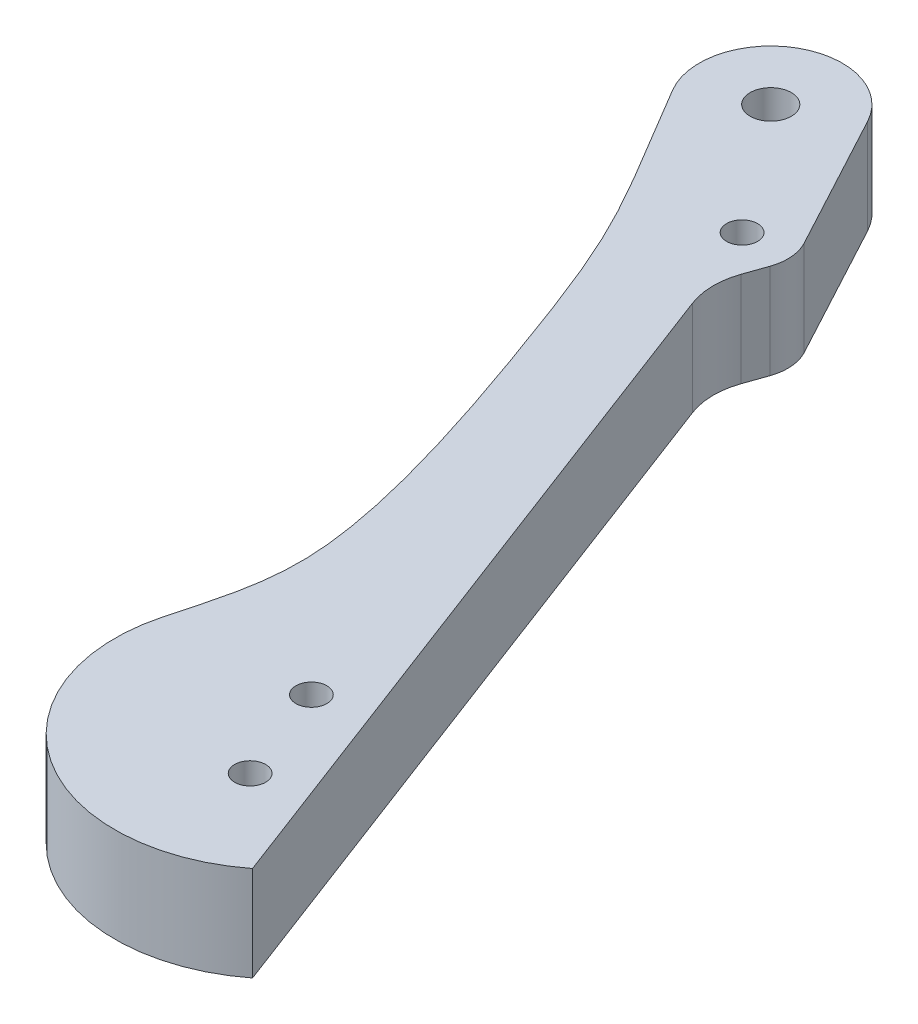
ISO-10303-21;
HEADER;
FILE_DESCRIPTION(('STEP AP214'),'2;1');
FILE_NAME('part.step','',(''),(''),'','','');
FILE_SCHEMA(('AUTOMOTIVE_DESIGN { 1 0 10303 214 1 1 1 1 }'));
ENDSEC;
DATA;
#1=APPLICATION_CONTEXT('core data for automotive mechanical design processes');
#2=APPLICATION_PROTOCOL_DEFINITION('international standard','automotive_design',2000,#1);
#3=PRODUCT_CONTEXT('',#1,'mechanical');
#4=PRODUCT('Part','Part','',(#3));
#5=PRODUCT_RELATED_PRODUCT_CATEGORY('part','',(#4));
#6=PRODUCT_DEFINITION_FORMATION('','',#4);
#7=PRODUCT_DEFINITION_CONTEXT('part definition',#1,'design');
#8=PRODUCT_DEFINITION('design','',#6,#7);
#9=PRODUCT_DEFINITION_SHAPE('','',#8);
#10=(LENGTH_UNIT() NAMED_UNIT(*) SI_UNIT(.MILLI.,.METRE.));
#11=(NAMED_UNIT(*) PLANE_ANGLE_UNIT() SI_UNIT($,.RADIAN.));
#12=(NAMED_UNIT(*) SI_UNIT($,.STERADIAN.) SOLID_ANGLE_UNIT());
#13=UNCERTAINTY_MEASURE_WITH_UNIT(LENGTH_MEASURE(1.E-05),#10,'distance_accuracy_value','');
#14=(GEOMETRIC_REPRESENTATION_CONTEXT(3) GLOBAL_UNCERTAINTY_ASSIGNED_CONTEXT((#13)) GLOBAL_UNIT_ASSIGNED_CONTEXT((#10,
#11,#12)) REPRESENTATION_CONTEXT('',''));
#15=CARTESIAN_POINT('',(0.,0.,0.));
#16=DIRECTION('',(0.,0.,1.));
#17=DIRECTION('',(1.,0.,0.));
#18=AXIS2_PLACEMENT_3D('',#15,#16,#17);
#19=CARTESIAN_POINT('',(-21.31,3.3655,-56.0881796816406));
#20=DIRECTION('',(0.,-1.,0.));
#21=DIRECTION('',(0.,0.,-1.));
#22=AXIS2_PLACEMENT_3D('',#19,#20,#21);
#23=CYLINDRICAL_SURFACE('',#22,5.07999999999994);
#24=DIRECTION('',(0.,-1.,0.));
#25=VECTOR('',#24,1.);
#26=CARTESIAN_POINT('',(-16.83509426146,3.3655,-58.4926793450178));
#27=LINE('',#26,#25);
#28=CARTESIAN_POINT('',(-16.83509426146,3.3655,-58.4926793450178));
#29=VERTEX_POINT('',#28);
#30=CARTESIAN_POINT('',(-16.83509426146,-3.3655,-58.4926793450178));
#31=VERTEX_POINT('',#30);
#32=EDGE_CURVE('E51',#29,#31,#27,.T.);
#33=ORIENTED_EDGE('',*,*,#32,.T.);
#34=CARTESIAN_POINT('',(-21.31,-3.3655,-56.0881796816406));
#35=DIRECTION('',(0.,1.,0.));
#36=DIRECTION('',(0.,0.,1.));
#37=AXIS2_PLACEMENT_3D('',#34,#35,#36);
#38=CIRCLE('',#37,5.07999999999994);
#39=CARTESIAN_POINT('',(-25.681909613569,-3.3655,-53.5011338121628));
#40=VERTEX_POINT('',#39);
#41=EDGE_CURVE('E116',#31,#40,#38,.T.);
#42=ORIENTED_EDGE('',*,*,#41,.T.);
#43=DIRECTION('',(0.,-1.,0.));
#44=VECTOR('',#43,1.);
#45=CARTESIAN_POINT('',(-25.681909613569,3.3655,-53.5011338121628));
#46=LINE('',#45,#44);
#47=CARTESIAN_POINT('',(-25.681909613569,3.3655,-53.5011338121628));
#48=VERTEX_POINT('',#47);
#49=EDGE_CURVE('E12',#48,#40,#46,.T.);
#50=ORIENTED_EDGE('',*,*,#49,.F.);
#51=CARTESIAN_POINT('',(-21.31,3.3655,-56.0881796816406));
#52=DIRECTION('',(0.,1.,0.));
#53=DIRECTION('',(0.,0.,1.));
#54=AXIS2_PLACEMENT_3D('',#51,#52,#53);
#55=CIRCLE('',#54,5.07999999999994);
#56=EDGE_CURVE('E148',#29,#48,#55,.T.);
#57=ORIENTED_EDGE('',*,*,#56,.F.);
#58=EDGE_LOOP('',(#33,#42,#50,#57));
#59=FACE_BOUND('',#58,.T.);
#60=ADVANCED_FACE('F37',(#59),#23,.T.);
#61=CARTESIAN_POINT('',(-25.681909613569,3.3655,-53.5011338121628));
#62=CARTESIAN_POINT('',(-20.1195331658376,3.3655,-44.1011431304994));
#63=CARTESIAN_POINT('',(-18.7376750377408,3.3655,-42.9359836652435));
#64=CARTESIAN_POINT('',(-8.46782273718162,3.3655,-12.7664044589389));
#65=CARTESIAN_POINT('',(-10.4932901005708,3.3655,-6.33361462432556));
#66=CARTESIAN_POINT('',(-11.3737766045538,3.3655,-3.04759425608218));
#67=B_SPLINE_CURVE_WITH_KNOTS('',3,(#61,#62,#63,#64,#65,#66),.UNSPECIFIED.,.F.,.F.,(4,1,1,4),
(0.,0.552956215726948,0.823039600781612,1.),.UNSPECIFIED.);
#68=DIRECTION('',(0.,-1.,0.));
#69=VECTOR('',#68,1.);
#70=SURFACE_OF_LINEAR_EXTRUSION('',#67,#69);
#71=ORIENTED_EDGE('',*,*,#49,.T.);
#72=CARTESIAN_POINT('',(-25.681909613569,-3.3655,-53.5011338121628));
#73=CARTESIAN_POINT('',(-20.1195331658376,-3.3655,-44.1011431304994));
#74=CARTESIAN_POINT('',(-18.7376750377408,-3.3655,-42.9359836652435));
#75=CARTESIAN_POINT('',(-8.46782273718162,-3.3655,-12.7664044589389));
#76=CARTESIAN_POINT('',(-10.4932901005708,-3.3655,-6.33361462432556));
#77=CARTESIAN_POINT('',(-11.3737766045538,-3.3655,-3.04759425608218));
#78=B_SPLINE_CURVE_WITH_KNOTS('',3,(#72,#73,#74,#75,#76,#77),.UNSPECIFIED.,.F.,.F.,(4,1,1,4),
(0.,0.552956215726948,0.823039600781612,1.),.UNSPECIFIED.);
#79=CARTESIAN_POINT('',(-11.3737766045538,-3.3655,-3.04759425608219));
#80=VERTEX_POINT('',#79);
#81=EDGE_CURVE('E105',#40,#80,#78,.T.);
#82=ORIENTED_EDGE('',*,*,#81,.T.);
#83=DIRECTION('',(0.,-1.,0.));
#84=VECTOR('',#83,1.);
#85=CARTESIAN_POINT('',(-11.3737766045538,3.3655,-3.04759425608219));
#86=LINE('',#85,#84);
#87=CARTESIAN_POINT('',(-11.3737766045538,3.3655,-3.04759425608219));
#88=VERTEX_POINT('',#87);
#89=EDGE_CURVE('E44',#88,#80,#86,.T.);
#90=ORIENTED_EDGE('',*,*,#89,.F.);
#91=EDGE_CURVE('E106',#48,#88,#67,.T.);
#92=ORIENTED_EDGE('',*,*,#91,.F.);
#93=EDGE_LOOP('',(#71,#82,#90,#92));
#94=FACE_BOUND('',#93,.T.);
#95=ADVANCED_FACE('F103',(#94),#70,.F.);
#96=CARTESIAN_POINT('',(0.,3.3655,0.));
#97=DIRECTION('',(0.,-1.,0.));
#98=DIRECTION('',(0.,0.,-1.));
#99=AXIS2_PLACEMENT_3D('',#96,#97,#98);
#100=CYLINDRICAL_SURFACE('',#99,11.775);
#101=ORIENTED_EDGE('',*,*,#89,.T.);
#102=CARTESIAN_POINT('',(0.,-3.3655,0.));
#103=DIRECTION('',(0.,1.,0.));
#104=DIRECTION('',(0.,0.,1.));
#105=AXIS2_PLACEMENT_3D('',#102,#103,#104);
#106=CIRCLE('',#105,11.775);
#107=CARTESIAN_POINT('',(7.26487943701259,-3.3655,9.26672281692248));
#108=VERTEX_POINT('',#107);
#109=EDGE_CURVE('E119',#108,#80,#106,.F.);
#110=ORIENTED_EDGE('',*,*,#109,.F.);
#111=DIRECTION('',(0.,-1.,0.));
#112=VECTOR('',#111,1.);
#113=CARTESIAN_POINT('',(7.26487943701259,3.3655,9.26672281692248));
#114=LINE('',#113,#112);
#115=CARTESIAN_POINT('',(7.26487943701259,3.3655,9.26672281692248));
#116=VERTEX_POINT('',#115);
#117=EDGE_CURVE('E190',#116,#108,#114,.T.);
#118=ORIENTED_EDGE('',*,*,#117,.F.);
#119=CARTESIAN_POINT('',(0.,3.3655,0.));
#120=DIRECTION('',(0.,1.,0.));
#121=DIRECTION('',(0.,0.,1.));
#122=AXIS2_PLACEMENT_3D('',#119,#120,#121);
#123=CIRCLE('',#122,11.775);
#124=EDGE_CURVE('E166',#116,#88,#123,.F.);
#125=ORIENTED_EDGE('',*,*,#124,.T.);
#126=EDGE_LOOP('',(#101,#110,#118,#125));
#127=FACE_BOUND('',#126,.T.);
#128=ADVANCED_FACE('F193',(#127),#100,.T.);
#129=CARTESIAN_POINT('',(3.27181048142904,3.3655,-1.24308333333333));
#130=DIRECTION('',(0.93480299469401,0.,-0.355166666666667));
#131=DIRECTION('',(-0.355166666666667,0.,-0.93480299469401));
#132=AXIS2_PLACEMENT_3D('',#129,#130,#131);
#133=PLANE('',#132);
#134=ORIENTED_EDGE('',*,*,#117,.T.);
#135=DIRECTION('',(0.355166666666667,0.,0.93480299469401));
#136=VECTOR('',#135,1.);
#137=CARTESIAN_POINT('',(3.27181048142904,-3.3655,-1.24308333333333));
#138=LINE('',#137,#136);
#139=CARTESIAN_POINT('',(-11.8774522572732,-3.3655,-41.1161274690778));
#140=VERTEX_POINT('',#139);
#141=EDGE_CURVE('E135',#140,#108,#138,.T.);
#142=ORIENTED_EDGE('',*,*,#141,.F.);
#143=DIRECTION('',(0.,-1.,0.));
#144=VECTOR('',#143,1.);
#145=CARTESIAN_POINT('',(-11.8774522572732,3.3655,-41.1161274690778));
#146=LINE('',#145,#144);
#147=CARTESIAN_POINT('',(-11.8774522572732,3.3655,-41.1161274690778));
#148=VERTEX_POINT('',#147);
#149=EDGE_CURVE('E188',#148,#140,#146,.T.);
#150=ORIENTED_EDGE('',*,*,#149,.F.);
#151=DIRECTION('',(0.355166666666667,0.,0.93480299469401));
#152=VECTOR('',#151,1.);
#153=CARTESIAN_POINT('',(3.27181048142904,3.3655,-1.24308333333333));
#154=LINE('',#153,#152);
#155=EDGE_CURVE('E162',#148,#116,#154,.T.);
#156=ORIENTED_EDGE('',*,*,#155,.T.);
#157=EDGE_LOOP('',(#134,#142,#150,#156));
#158=FACE_BOUND('',#157,.T.);
#159=ADVANCED_FACE('F212',(#158),#133,.T.);
#160=CARTESIAN_POINT('',(-7.12865304422766,3.3655,-42.9203741357445));
#161=DIRECTION('',(0.,-1.,0.));
#162=DIRECTION('',(0.,0.,-1.));
#163=AXIS2_PLACEMENT_3D('',#160,#161,#162);
#164=CYLINDRICAL_SURFACE('',#163,5.08);
#165=ORIENTED_EDGE('',*,*,#149,.T.);
#166=CARTESIAN_POINT('',(-7.12865304422766,-3.3655,-42.9203741357445));
#167=DIRECTION('',(0.,1.,0.));
#168=DIRECTION('',(0.,0.,1.));
#169=AXIS2_PLACEMENT_3D('',#166,#167,#168);
#170=CIRCLE('',#169,5.08);
#171=CARTESIAN_POINT('',(-11.9222646723086,-3.3655,-44.601947077703));
#172=VERTEX_POINT('',#171);
#173=EDGE_CURVE('E137',#172,#140,#170,.T.);
#174=ORIENTED_EDGE('',*,*,#173,.F.);
#175=DIRECTION('',(0.,-1.,0.));
#176=VECTOR('',#175,1.);
#177=CARTESIAN_POINT('',(-11.9222646723086,3.3655,-44.601947077703));
#178=LINE('',#177,#176);
#179=CARTESIAN_POINT('',(-11.9222646723086,3.3655,-44.601947077703));
#180=VERTEX_POINT('',#179);
#181=EDGE_CURVE('E186',#180,#172,#178,.T.);
#182=ORIENTED_EDGE('',*,*,#181,.F.);
#183=CARTESIAN_POINT('',(-7.12865304422766,3.3655,-42.9203741357445));
#184=DIRECTION('',(0.,1.,0.));
#185=DIRECTION('',(0.,0.,1.));
#186=AXIS2_PLACEMENT_3D('',#183,#184,#185);
#187=CIRCLE('',#186,5.08);
#188=EDGE_CURVE('E165',#180,#148,#187,.T.);
#189=ORIENTED_EDGE('',*,*,#188,.T.);
#190=EDGE_LOOP('',(#165,#174,#182,#189));
#191=FACE_BOUND('',#190,.T.);
#192=ADVANCED_FACE('F209',(#191),#164,.F.);
#193=CARTESIAN_POINT('',(-24.5476318233555,3.3655,-8.61117601215411));
#194=DIRECTION('',(0.943624336236411,0.,0.331018295661121));
#195=DIRECTION('',(0.331018295661121,0.,-0.943624336236411));
#196=AXIS2_PLACEMENT_3D('',#193,#194,#195);
#197=PLANE('',#196);
#198=ORIENTED_EDGE('',*,*,#181,.T.);
#199=DIRECTION('',(-0.331018295661121,0.,0.943624336236411));
#200=VECTOR('',#199,1.);
#201=CARTESIAN_POINT('',(-24.5476318233555,-3.3655,-8.61117601215411));
#202=LINE('',#201,#200);
#203=CARTESIAN_POINT('',(-11.3889084922808,-3.3655,-46.1223702022049));
#204=VERTEX_POINT('',#203);
#205=EDGE_CURVE('E140',#204,#172,#202,.T.);
#206=ORIENTED_EDGE('',*,*,#205,.F.);
#207=DIRECTION('',(0.,-1.,0.));
#208=VECTOR('',#207,1.);
#209=CARTESIAN_POINT('',(-11.3889084922808,3.3655,-46.1223702022049));
#210=LINE('',#209,#208);
#211=CARTESIAN_POINT('',(-11.3889084922808,3.3655,-46.1223702022049));
#212=VERTEX_POINT('',#211);
#213=EDGE_CURVE('E184',#212,#204,#210,.T.);
#214=ORIENTED_EDGE('',*,*,#213,.F.);
#215=DIRECTION('',(-0.331018295661121,0.,0.943624336236411));
#216=VECTOR('',#215,1.);
#217=CARTESIAN_POINT('',(-24.5476318233555,3.3655,-8.61117601215411));
#218=LINE('',#217,#216);
#219=EDGE_CURVE('E170',#212,#180,#218,.T.);
#220=ORIENTED_EDGE('',*,*,#219,.T.);
#221=EDGE_LOOP('',(#198,#206,#214,#220));
#222=FACE_BOUND('',#221,.T.);
#223=ADVANCED_FACE('F206',(#222),#197,.T.);
#224=CARTESIAN_POINT('',(-14.4556876378921,3.3655,-47.1981796816406));
#225=DIRECTION('',(0.,-1.,0.));
#226=DIRECTION('',(0.,0.,-1.));
#227=AXIS2_PLACEMENT_3D('',#224,#225,#226);
#228=CYLINDRICAL_SURFACE('',#227,3.250000056);
#229=ORIENTED_EDGE('',*,*,#213,.T.);
#230=CARTESIAN_POINT('',(-14.4556876378921,-3.3655,-47.1981796816406));
#231=DIRECTION('',(0.,1.,0.));
#232=DIRECTION('',(0.,0.,1.));
#233=AXIS2_PLACEMENT_3D('',#230,#231,#232);
#234=CIRCLE('',#233,3.250000056);
#235=CARTESIAN_POINT('',(-11.5928049802444,-3.3655,-48.7364915006618));
#236=VERTEX_POINT('',#235);
#237=EDGE_CURVE('E143',#236,#204,#234,.F.);
#238=ORIENTED_EDGE('',*,*,#237,.F.);
#239=DIRECTION('',(0.,-1.,0.));
#240=VECTOR('',#239,1.);
#241=CARTESIAN_POINT('',(-11.5928049802444,3.3655,-48.7364915006618));
#242=LINE('',#241,#240);
#243=CARTESIAN_POINT('',(-11.5928049802444,3.3655,-48.7364915006618));
#244=VERTEX_POINT('',#243);
#245=EDGE_CURVE('E59',#244,#236,#242,.T.);
#246=ORIENTED_EDGE('',*,*,#245,.F.);
#247=CARTESIAN_POINT('',(-14.4556876378921,3.3655,-47.1981796816406));
#248=DIRECTION('',(0.,1.,0.));
#249=DIRECTION('',(0.,0.,1.));
#250=AXIS2_PLACEMENT_3D('',#247,#248,#249);
#251=CIRCLE('',#250,3.250000056);
#252=EDGE_CURVE('E174',#244,#212,#251,.F.);
#253=ORIENTED_EDGE('',*,*,#252,.T.);
#254=EDGE_LOOP('',(#229,#238,#246,#253));
#255=FACE_BOUND('',#254,.T.);
#256=ADVANCED_FACE('F202',(#255),#228,.T.);
#257=CARTESIAN_POINT('',(11.3249753941575,3.3655,-6.08524539153555));
#258=DIRECTION('',(0.880886956405527,0.,-0.473326705389214));
#259=DIRECTION('',(-0.473326705389214,0.,-0.880886956405527));
#260=AXIS2_PLACEMENT_3D('',#257,#258,#259);
#261=PLANE('',#260);
#262=ORIENTED_EDGE('',*,*,#245,.T.);
#263=DIRECTION('',(0.473326705389214,0.,0.880886956405527));
#264=VECTOR('',#263,1.);
#265=CARTESIAN_POINT('',(11.3249753941575,-3.3655,-6.08524539153555));
#266=LINE('',#265,#264);
#267=EDGE_CURVE('E146',#31,#236,#266,.T.);
#268=ORIENTED_EDGE('',*,*,#267,.F.);
#269=ORIENTED_EDGE('',*,*,#32,.F.);
#270=DIRECTION('',(0.473326705389214,0.,0.880886956405527));
#271=VECTOR('',#270,1.);
#272=CARTESIAN_POINT('',(11.3249753941575,3.3655,-6.08524539153555));
#273=LINE('',#272,#271);
#274=EDGE_CURVE('E179',#29,#244,#273,.T.);
#275=ORIENTED_EDGE('',*,*,#274,.T.);
#276=EDGE_LOOP('',(#262,#268,#269,#275));
#277=FACE_BOUND('',#276,.T.);
#278=ADVANCED_FACE('F201',(#277),#261,.T.);
#279=CARTESIAN_POINT('',(0.,3.3655,0.));
#280=DIRECTION('',(0.,1.,0.));
#281=DIRECTION('',(0.,0.,1.));
#282=AXIS2_PLACEMENT_3D('',#279,#280,#281);
#283=PLANE('',#282);
#284=ORIENTED_EDGE('',*,*,#56,.T.);
#285=ORIENTED_EDGE('',*,*,#91,.T.);
#286=ORIENTED_EDGE('',*,*,#124,.F.);
#287=ORIENTED_EDGE('',*,*,#155,.F.);
#288=ORIENTED_EDGE('',*,*,#188,.F.);
#289=ORIENTED_EDGE('',*,*,#219,.F.);
#290=ORIENTED_EDGE('',*,*,#252,.F.);
#291=ORIENTED_EDGE('',*,*,#274,.F.);
#292=EDGE_LOOP('',(#284,#285,#286,#287,#288,#289,#290,#291));
#293=FACE_BOUND('',#292,.T.);
#294=CARTESIAN_POINT('',(-21.31,3.3655,-56.0881796816406));
#295=DIRECTION('',(0.,1.,0.));
#296=DIRECTION('',(0.,0.,1.));
#297=AXIS2_PLACEMENT_3D('',#294,#295,#296);
#298=CIRCLE('',#297,1.4605);
#299=CARTESIAN_POINT('',(-21.31,3.3655,-54.6276796816406));
#300=VERTEX_POINT('',#299);
#301=EDGE_CURVE('E124',#300,#300,#298,.T.);
#302=ORIENTED_EDGE('',*,*,#301,.F.);
#303=EDGE_LOOP('',(#302));
#304=FACE_BOUND('',#303,.T.);
#305=CARTESIAN_POINT('',(-14.4556876378921,3.3655,-47.1981796816406));
#306=DIRECTION('',(0.,1.,0.));
#307=DIRECTION('',(0.,0.,1.));
#308=AXIS2_PLACEMENT_3D('',#305,#306,#307);
#309=CIRCLE('',#308,1.1);
#310=CARTESIAN_POINT('',(-14.4556876378921,3.3655,-46.0981796816406));
#311=VERTEX_POINT('',#310);
#312=EDGE_CURVE('E344',#311,#311,#309,.T.);
#313=ORIENTED_EDGE('',*,*,#312,.F.);
#314=EDGE_LOOP('',(#313));
#315=FACE_BOUND('',#314,.T.);
#316=CARTESIAN_POINT('',(1.331875,3.3655,3.50551123010254));
#317=DIRECTION('',(0.,1.,0.));
#318=DIRECTION('',(0.,0.,1.));
#319=AXIS2_PLACEMENT_3D('',#316,#317,#318);
#320=CIRCLE('',#319,1.1);
#321=CARTESIAN_POINT('',(1.331875,3.3655,4.60551123010254));
#322=VERTEX_POINT('',#321);
#323=EDGE_CURVE('E337',#322,#322,#320,.T.);
#324=ORIENTED_EDGE('',*,*,#323,.F.);
#325=EDGE_LOOP('',(#324));
#326=FACE_BOUND('',#325,.T.);
#327=CARTESIAN_POINT('',(-1.331875,3.3655,-3.50551123010254));
#328=DIRECTION('',(0.,1.,0.));
#329=DIRECTION('',(0.,0.,1.));
#330=AXIS2_PLACEMENT_3D('',#327,#328,#329);
#331=CIRCLE('',#330,1.1);
#332=CARTESIAN_POINT('',(-1.331875,3.3655,-2.40551123010254));
#333=VERTEX_POINT('',#332);
#334=EDGE_CURVE('E335',#333,#333,#331,.T.);
#335=ORIENTED_EDGE('',*,*,#334,.F.);
#336=EDGE_LOOP('',(#335));
#337=FACE_BOUND('',#336,.T.);
#338=ADVANCED_FACE('F197',(#293,#304,#315,#326,#337),#283,.T.);
#339=CARTESIAN_POINT('',(0.,-3.3655,0.));
#340=DIRECTION('',(0.,1.,0.));
#341=DIRECTION('',(0.,0.,1.));
#342=AXIS2_PLACEMENT_3D('',#339,#340,#341);
#343=PLANE('',#342);
#344=ORIENTED_EDGE('',*,*,#41,.F.);
#345=ORIENTED_EDGE('',*,*,#267,.T.);
#346=ORIENTED_EDGE('',*,*,#237,.T.);
#347=ORIENTED_EDGE('',*,*,#205,.T.);
#348=ORIENTED_EDGE('',*,*,#173,.T.);
#349=ORIENTED_EDGE('',*,*,#141,.T.);
#350=ORIENTED_EDGE('',*,*,#109,.T.);
#351=ORIENTED_EDGE('',*,*,#81,.F.);
#352=EDGE_LOOP('',(#344,#345,#346,#347,#348,#349,#350,#351));
#353=FACE_BOUND('',#352,.T.);
#354=CARTESIAN_POINT('',(-21.31,-3.3655,-56.0881796816406));
#355=DIRECTION('',(0.,1.,0.));
#356=DIRECTION('',(0.,0.,1.));
#357=AXIS2_PLACEMENT_3D('',#354,#355,#356);
#358=CIRCLE('',#357,1.4605);
#359=CARTESIAN_POINT('',(-21.31,-3.3655,-54.6276796816406));
#360=VERTEX_POINT('',#359);
#361=EDGE_CURVE('E121',#360,#360,#358,.F.);
#362=ORIENTED_EDGE('',*,*,#361,.F.);
#363=EDGE_LOOP('',(#362));
#364=FACE_BOUND('',#363,.T.);
#365=CARTESIAN_POINT('',(-14.4556876378921,-3.3655,-47.1981796816406));
#366=DIRECTION('',(0.,1.,0.));
#367=DIRECTION('',(0.,0.,1.));
#368=AXIS2_PLACEMENT_3D('',#365,#366,#367);
#369=CIRCLE('',#368,1.1);
#370=CARTESIAN_POINT('',(-14.4556876378921,-3.3655,-46.0981796816406));
#371=VERTEX_POINT('',#370);
#372=EDGE_CURVE('E348',#371,#371,#369,.F.);
#373=ORIENTED_EDGE('',*,*,#372,.F.);
#374=EDGE_LOOP('',(#373));
#375=FACE_BOUND('',#374,.T.);
#376=CARTESIAN_POINT('',(1.331875,-3.3655,3.50551123010254));
#377=DIRECTION('',(0.,1.,0.));
#378=DIRECTION('',(0.,0.,1.));
#379=AXIS2_PLACEMENT_3D('',#376,#377,#378);
#380=CIRCLE('',#379,1.1);
#381=CARTESIAN_POINT('',(1.331875,-3.3655,4.60551123010254));
#382=VERTEX_POINT('',#381);
#383=EDGE_CURVE('E341',#382,#382,#380,.F.);
#384=ORIENTED_EDGE('',*,*,#383,.F.);
#385=EDGE_LOOP('',(#384));
#386=FACE_BOUND('',#385,.T.);
#387=CARTESIAN_POINT('',(-1.331875,-3.3655,-3.50551123010254));
#388=DIRECTION('',(0.,1.,0.));
#389=DIRECTION('',(0.,0.,1.));
#390=AXIS2_PLACEMENT_3D('',#387,#388,#389);
#391=CIRCLE('',#390,1.1);
#392=CARTESIAN_POINT('',(-1.331875,-3.3655,-2.40551123010254));
#393=VERTEX_POINT('',#392);
#394=EDGE_CURVE('E332',#393,#393,#391,.F.);
#395=ORIENTED_EDGE('',*,*,#394,.F.);
#396=EDGE_LOOP('',(#395));
#397=FACE_BOUND('',#396,.T.);
#398=ADVANCED_FACE('F113',(#353,#364,#375,#386,#397),#343,.F.);
#399=CARTESIAN_POINT('',(-21.31,-7.85562806053457,-56.0881796816406));
#400=DIRECTION('',(0.,1.,0.));
#401=DIRECTION('',(0.,0.,1.));
#402=AXIS2_PLACEMENT_3D('',#399,#400,#401);
#403=CYLINDRICAL_SURFACE('',#402,1.4605);
#404=CARTESIAN_POINT('',(-21.31,-3.3655,-54.6276796816406));
#405=CARTESIAN_POINT('',(-21.31,-3.29538541666667,-54.6276796816406));
#406=CARTESIAN_POINT('',(-21.31,-3.22527083333333,-54.6276796816406));
#407=CARTESIAN_POINT('',(-21.31,-3.08504166666667,-54.6276796816406));
#408=CARTESIAN_POINT('',(-21.31,-3.01492708333333,-54.6276796816406));
#409=CARTESIAN_POINT('',(-21.31,-2.87469791666667,-54.6276796816406));
#410=CARTESIAN_POINT('',(-21.31,-2.80458333333333,-54.6276796816406));
#411=CARTESIAN_POINT('',(-21.31,-2.66435416666667,-54.6276796816406));
#412=CARTESIAN_POINT('',(-21.31,-2.59423958333333,-54.6276796816406));
#413=CARTESIAN_POINT('',(-21.31,-2.45401041666667,-54.6276796816406));
#414=CARTESIAN_POINT('',(-21.31,-2.38389583333333,-54.6276796816406));
#415=CARTESIAN_POINT('',(-21.31,-2.24366666666667,-54.6276796816406));
#416=CARTESIAN_POINT('',(-21.31,-2.17355208333333,-54.6276796816406));
#417=CARTESIAN_POINT('',(-21.31,-2.03332291666667,-54.6276796816406));
#418=CARTESIAN_POINT('',(-21.31,-1.96320833333333,-54.6276796816406));
#419=CARTESIAN_POINT('',(-21.31,-1.82297916666667,-54.6276796816406));
#420=CARTESIAN_POINT('',(-21.31,-1.75286458333333,-54.6276796816406));
#421=CARTESIAN_POINT('',(-21.31,-1.61263541666667,-54.6276796816406));
#422=CARTESIAN_POINT('',(-21.31,-1.54252083333333,-54.6276796816406));
#423=CARTESIAN_POINT('',(-21.31,-1.40229166666667,-54.6276796816406));
#424=CARTESIAN_POINT('',(-21.31,-1.33217708333333,-54.6276796816406));
#425=CARTESIAN_POINT('',(-21.31,-1.19194791666667,-54.6276796816406));
#426=CARTESIAN_POINT('',(-21.31,-1.12183333333333,-54.6276796816406));
#427=CARTESIAN_POINT('',(-21.31,-0.981604166666667,-54.6276796816406));
#428=CARTESIAN_POINT('',(-21.31,-0.911489583333334,-54.6276796816406));
#429=CARTESIAN_POINT('',(-21.31,-0.771260416666668,-54.6276796816406));
#430=CARTESIAN_POINT('',(-21.31,-0.701145833333335,-54.6276796816406));
#431=CARTESIAN_POINT('',(-21.31,-0.560916666666668,-54.6276796816406));
#432=CARTESIAN_POINT('',(-21.31,-0.490802083333334,-54.6276796816406));
#433=CARTESIAN_POINT('',(-21.31,-0.350572916666667,-54.6276796816406));
#434=CARTESIAN_POINT('',(-21.31,-0.280458333333334,-54.6276796816406));
#435=CARTESIAN_POINT('',(-21.31,-0.140229166666668,-54.6276796816406));
#436=CARTESIAN_POINT('',(-21.31,-0.0701145833333346,-54.6276796816406));
#437=CARTESIAN_POINT('',(-21.31,0.0701145833333315,-54.6276796816406));
#438=CARTESIAN_POINT('',(-21.31,0.140229166666665,-54.6276796816406));
#439=CARTESIAN_POINT('',(-21.31,0.280458333333331,-54.6276796816406));
#440=CARTESIAN_POINT('',(-21.31,0.350572916666664,-54.6276796816406));
#441=CARTESIAN_POINT('',(-21.31,0.490802083333331,-54.6276796816406));
#442=CARTESIAN_POINT('',(-21.31,0.560916666666665,-54.6276796816406));
#443=CARTESIAN_POINT('',(-21.31,0.701145833333332,-54.6276796816406));
#444=CARTESIAN_POINT('',(-21.31,0.771260416666665,-54.6276796816406));
#445=CARTESIAN_POINT('',(-21.31,0.911489583333332,-54.6276796816406));
#446=CARTESIAN_POINT('',(-21.31,0.981604166666665,-54.6276796816406));
#447=CARTESIAN_POINT('',(-21.31,1.12183333333333,-54.6276796816406));
#448=CARTESIAN_POINT('',(-21.31,1.19194791666667,-54.6276796816406));
#449=CARTESIAN_POINT('',(-21.31,1.33217708333333,-54.6276796816406));
#450=CARTESIAN_POINT('',(-21.31,1.40229166666667,-54.6276796816406));
#451=CARTESIAN_POINT('',(-21.31,1.54252083333333,-54.6276796816406));
#452=CARTESIAN_POINT('',(-21.31,1.61263541666667,-54.6276796816406));
#453=CARTESIAN_POINT('',(-21.31,1.75286458333333,-54.6276796816406));
#454=CARTESIAN_POINT('',(-21.31,1.82297916666666,-54.6276796816406));
#455=CARTESIAN_POINT('',(-21.31,1.96320833333333,-54.6276796816406));
#456=CARTESIAN_POINT('',(-21.31,2.03332291666666,-54.6276796816406));
#457=CARTESIAN_POINT('',(-21.31,2.17355208333333,-54.6276796816406));
#458=CARTESIAN_POINT('',(-21.31,2.24366666666667,-54.6276796816406));
#459=CARTESIAN_POINT('',(-21.31,2.38389583333333,-54.6276796816406));
#460=CARTESIAN_POINT('',(-21.31,2.45401041666667,-54.6276796816406));
#461=CARTESIAN_POINT('',(-21.31,2.59423958333333,-54.6276796816406));
#462=CARTESIAN_POINT('',(-21.31,2.66435416666667,-54.6276796816406));
#463=CARTESIAN_POINT('',(-21.31,2.80458333333333,-54.6276796816406));
#464=CARTESIAN_POINT('',(-21.31,2.87469791666667,-54.6276796816406));
#465=CARTESIAN_POINT('',(-21.31,3.01492708333333,-54.6276796816406));
#466=CARTESIAN_POINT('',(-21.31,3.08504166666667,-54.6276796816406));
#467=CARTESIAN_POINT('',(-21.31,3.22527083333333,-54.6276796816406));
#468=CARTESIAN_POINT('',(-21.31,3.29538541666667,-54.6276796816406));
#469=CARTESIAN_POINT('',(-21.31,3.3655,-54.6276796816406));
#470=B_SPLINE_CURVE_WITH_KNOTS('',3,(#404,#405,#406,#407,#408,#409,#410,#411,#412,#413,#414,
#415,#416,#417,#418,#419,#420,#421,#422,#423,#424,#425,#426,#427,#428,#429,#430,#431,#432,#433,
#434,#435,#436,#437,#438,#439,#440,#441,#442,#443,#444,#445,#446,#447,#448,#449,#450,#451,#452,
#453,#454,#455,#456,#457,#458,#459,#460,#461,#462,#463,#464,#465,#466,#467,#468,#469),
.UNSPECIFIED.,.F.,.F.,(4,2,2,2,2,2,2,2,2,2,2,2,2,2,2,2,2,2,2,2,2,2,2,2,2,2,2,2,2,2,2,2,4),(0.,
0.21034375,0.4206875,0.63103125,0.841375,1.05171875,1.2620625,1.47240625,1.68275,1.89309375,
2.1034375,2.31378125,2.524125,2.73446875,2.9448125,3.15515625,3.3655,3.57584375,3.7861875,
3.99653125,4.206875,4.41721875,4.6275625,4.83790625,5.04825,5.25859375,5.4689375,5.67928125,
5.889625,6.09996875,6.3103125,6.52065625,6.731),.UNSPECIFIED.);
#471=EDGE_CURVE('BSEAM285',#360,#300,#470,.T.);
#472=ORIENTED_EDGE('',*,*,#361,.T.);
#473=ORIENTED_EDGE('',*,*,#301,.T.);
#474=ORIENTED_EDGE('',*,*,#471,.T.);
#475=ORIENTED_EDGE('',*,*,#471,.F.);
#476=EDGE_LOOP('',(#472,#474,#473,#475));
#477=FACE_BOUND('',#476,.T.);
#478=ADVANCED_FACE('F285',(#477),#403,.F.);
#479=CARTESIAN_POINT('',(-14.4556876378921,-7.85562806053457,-47.1981796816406));
#480=DIRECTION('',(0.,1.,0.));
#481=DIRECTION('',(0.,0.,1.));
#482=AXIS2_PLACEMENT_3D('',#479,#480,#481);
#483=CYLINDRICAL_SURFACE('',#482,1.1);
#484=CARTESIAN_POINT('',(-14.4556876378921,-3.3655,-46.0981796816406));
#485=CARTESIAN_POINT('',(-14.4556876378921,-3.29538541666667,-46.0981796816406));
#486=CARTESIAN_POINT('',(-14.4556876378921,-3.22527083333333,-46.0981796816406));
#487=CARTESIAN_POINT('',(-14.4556876378921,-3.08504166666667,-46.0981796816406));
#488=CARTESIAN_POINT('',(-14.4556876378921,-3.01492708333333,-46.0981796816406));
#489=CARTESIAN_POINT('',(-14.4556876378921,-2.87469791666667,-46.0981796816406));
#490=CARTESIAN_POINT('',(-14.4556876378921,-2.80458333333333,-46.0981796816406));
#491=CARTESIAN_POINT('',(-14.4556876378921,-2.66435416666667,-46.0981796816406));
#492=CARTESIAN_POINT('',(-14.4556876378921,-2.59423958333333,-46.0981796816406));
#493=CARTESIAN_POINT('',(-14.4556876378921,-2.45401041666667,-46.0981796816406));
#494=CARTESIAN_POINT('',(-14.4556876378921,-2.38389583333333,-46.0981796816406));
#495=CARTESIAN_POINT('',(-14.4556876378921,-2.24366666666667,-46.0981796816406));
#496=CARTESIAN_POINT('',(-14.4556876378921,-2.17355208333333,-46.0981796816406));
#497=CARTESIAN_POINT('',(-14.4556876378921,-2.03332291666667,-46.0981796816406));
#498=CARTESIAN_POINT('',(-14.4556876378921,-1.96320833333333,-46.0981796816406));
#499=CARTESIAN_POINT('',(-14.4556876378921,-1.82297916666667,-46.0981796816406));
#500=CARTESIAN_POINT('',(-14.4556876378921,-1.75286458333333,-46.0981796816406));
#501=CARTESIAN_POINT('',(-14.4556876378921,-1.61263541666667,-46.0981796816406));
#502=CARTESIAN_POINT('',(-14.4556876378921,-1.54252083333333,-46.0981796816406));
#503=CARTESIAN_POINT('',(-14.4556876378921,-1.40229166666667,-46.0981796816406));
#504=CARTESIAN_POINT('',(-14.4556876378921,-1.33217708333333,-46.0981796816406));
#505=CARTESIAN_POINT('',(-14.4556876378921,-1.19194791666667,-46.0981796816406));
#506=CARTESIAN_POINT('',(-14.4556876378921,-1.12183333333333,-46.0981796816406));
#507=CARTESIAN_POINT('',(-14.4556876378921,-0.981604166666667,-46.0981796816406));
#508=CARTESIAN_POINT('',(-14.4556876378921,-0.911489583333334,-46.0981796816406));
#509=CARTESIAN_POINT('',(-14.4556876378921,-0.771260416666668,-46.0981796816406));
#510=CARTESIAN_POINT('',(-14.4556876378921,-0.701145833333335,-46.0981796816406));
#511=CARTESIAN_POINT('',(-14.4556876378921,-0.560916666666668,-46.0981796816406));
#512=CARTESIAN_POINT('',(-14.4556876378921,-0.490802083333334,-46.0981796816406));
#513=CARTESIAN_POINT('',(-14.4556876378921,-0.350572916666667,-46.0981796816406));
#514=CARTESIAN_POINT('',(-14.4556876378921,-0.280458333333334,-46.0981796816406));
#515=CARTESIAN_POINT('',(-14.4556876378921,-0.140229166666668,-46.0981796816406));
#516=CARTESIAN_POINT('',(-14.4556876378921,-0.0701145833333346,-46.0981796816406));
#517=CARTESIAN_POINT('',(-14.4556876378921,0.0701145833333315,-46.0981796816406));
#518=CARTESIAN_POINT('',(-14.4556876378921,0.140229166666665,-46.0981796816406));
#519=CARTESIAN_POINT('',(-14.4556876378921,0.280458333333331,-46.0981796816406));
#520=CARTESIAN_POINT('',(-14.4556876378921,0.350572916666664,-46.0981796816406));
#521=CARTESIAN_POINT('',(-14.4556876378921,0.490802083333331,-46.0981796816406));
#522=CARTESIAN_POINT('',(-14.4556876378921,0.560916666666665,-46.0981796816406));
#523=CARTESIAN_POINT('',(-14.4556876378921,0.701145833333332,-46.0981796816406));
#524=CARTESIAN_POINT('',(-14.4556876378921,0.771260416666665,-46.0981796816406));
#525=CARTESIAN_POINT('',(-14.4556876378921,0.911489583333332,-46.0981796816406));
#526=CARTESIAN_POINT('',(-14.4556876378921,0.981604166666665,-46.0981796816406));
#527=CARTESIAN_POINT('',(-14.4556876378921,1.12183333333333,-46.0981796816406));
#528=CARTESIAN_POINT('',(-14.4556876378921,1.19194791666667,-46.0981796816406));
#529=CARTESIAN_POINT('',(-14.4556876378921,1.33217708333333,-46.0981796816406));
#530=CARTESIAN_POINT('',(-14.4556876378921,1.40229166666667,-46.0981796816406));
#531=CARTESIAN_POINT('',(-14.4556876378921,1.54252083333333,-46.0981796816406));
#532=CARTESIAN_POINT('',(-14.4556876378921,1.61263541666667,-46.0981796816406));
#533=CARTESIAN_POINT('',(-14.4556876378921,1.75286458333333,-46.0981796816406));
#534=CARTESIAN_POINT('',(-14.4556876378921,1.82297916666666,-46.0981796816406));
#535=CARTESIAN_POINT('',(-14.4556876378921,1.96320833333333,-46.0981796816406));
#536=CARTESIAN_POINT('',(-14.4556876378921,2.03332291666666,-46.0981796816406));
#537=CARTESIAN_POINT('',(-14.4556876378921,2.17355208333333,-46.0981796816406));
#538=CARTESIAN_POINT('',(-14.4556876378921,2.24366666666667,-46.0981796816406));
#539=CARTESIAN_POINT('',(-14.4556876378921,2.38389583333333,-46.0981796816406));
#540=CARTESIAN_POINT('',(-14.4556876378921,2.45401041666667,-46.0981796816406));
#541=CARTESIAN_POINT('',(-14.4556876378921,2.59423958333333,-46.0981796816406));
#542=CARTESIAN_POINT('',(-14.4556876378921,2.66435416666667,-46.0981796816406));
#543=CARTESIAN_POINT('',(-14.4556876378921,2.80458333333333,-46.0981796816406));
#544=CARTESIAN_POINT('',(-14.4556876378921,2.87469791666667,-46.0981796816406));
#545=CARTESIAN_POINT('',(-14.4556876378921,3.01492708333333,-46.0981796816406));
#546=CARTESIAN_POINT('',(-14.4556876378921,3.08504166666667,-46.0981796816406));
#547=CARTESIAN_POINT('',(-14.4556876378921,3.22527083333333,-46.0981796816406));
#548=CARTESIAN_POINT('',(-14.4556876378921,3.29538541666667,-46.0981796816406));
#549=CARTESIAN_POINT('',(-14.4556876378921,3.3655,-46.0981796816406));
#550=B_SPLINE_CURVE_WITH_KNOTS('',3,(#484,#485,#486,#487,#488,#489,#490,#491,#492,#493,#494,
#495,#496,#497,#498,#499,#500,#501,#502,#503,#504,#505,#506,#507,#508,#509,#510,#511,#512,#513,
#514,#515,#516,#517,#518,#519,#520,#521,#522,#523,#524,#525,#526,#527,#528,#529,#530,#531,#532,
#533,#534,#535,#536,#537,#538,#539,#540,#541,#542,#543,#544,#545,#546,#547,#548,#549),
.UNSPECIFIED.,.F.,.F.,(4,2,2,2,2,2,2,2,2,2,2,2,2,2,2,2,2,2,2,2,2,2,2,2,2,2,2,2,2,2,2,2,4),(0.,
0.21034375,0.4206875,0.63103125,0.841375,1.05171875,1.2620625,1.47240625,1.68275,1.89309375,
2.1034375,2.31378125,2.524125,2.73446875,2.9448125,3.15515625,3.3655,3.57584375,3.7861875,
3.99653125,4.206875,4.41721875,4.6275625,4.83790625,5.04825,5.25859375,5.4689375,5.67928125,
5.889625,6.09996875,6.3103125,6.52065625,6.731),.UNSPECIFIED.);
#551=EDGE_CURVE('BSEAM295',#371,#311,#550,.T.);
#552=ORIENTED_EDGE('',*,*,#372,.T.);
#553=ORIENTED_EDGE('',*,*,#312,.T.);
#554=ORIENTED_EDGE('',*,*,#551,.T.);
#555=ORIENTED_EDGE('',*,*,#551,.F.);
#556=EDGE_LOOP('',(#552,#554,#553,#555));
#557=FACE_BOUND('',#556,.T.);
#558=ADVANCED_FACE('F295',(#557),#483,.F.);
#559=CARTESIAN_POINT('',(1.331875,-7.85562806053457,3.50551123010254));
#560=DIRECTION('',(0.,1.,0.));
#561=DIRECTION('',(0.,0.,1.));
#562=AXIS2_PLACEMENT_3D('',#559,#560,#561);
#563=CYLINDRICAL_SURFACE('',#562,1.1);
#564=CARTESIAN_POINT('',(1.331875,-3.3655,4.60551123010254));
#565=CARTESIAN_POINT('',(1.331875,-3.29538541666667,4.60551123010254));
#566=CARTESIAN_POINT('',(1.331875,-3.22527083333333,4.60551123010254));
#567=CARTESIAN_POINT('',(1.331875,-3.08504166666667,4.60551123010254));
#568=CARTESIAN_POINT('',(1.331875,-3.01492708333333,4.60551123010254));
#569=CARTESIAN_POINT('',(1.331875,-2.87469791666667,4.60551123010254));
#570=CARTESIAN_POINT('',(1.331875,-2.80458333333333,4.60551123010254));
#571=CARTESIAN_POINT('',(1.331875,-2.66435416666667,4.60551123010254));
#572=CARTESIAN_POINT('',(1.331875,-2.59423958333333,4.60551123010254));
#573=CARTESIAN_POINT('',(1.331875,-2.45401041666667,4.60551123010254));
#574=CARTESIAN_POINT('',(1.331875,-2.38389583333333,4.60551123010254));
#575=CARTESIAN_POINT('',(1.331875,-2.24366666666667,4.60551123010254));
#576=CARTESIAN_POINT('',(1.331875,-2.17355208333333,4.60551123010254));
#577=CARTESIAN_POINT('',(1.331875,-2.03332291666667,4.60551123010254));
#578=CARTESIAN_POINT('',(1.331875,-1.96320833333333,4.60551123010254));
#579=CARTESIAN_POINT('',(1.331875,-1.82297916666667,4.60551123010254));
#580=CARTESIAN_POINT('',(1.331875,-1.75286458333333,4.60551123010254));
#581=CARTESIAN_POINT('',(1.331875,-1.61263541666667,4.60551123010254));
#582=CARTESIAN_POINT('',(1.331875,-1.54252083333333,4.60551123010254));
#583=CARTESIAN_POINT('',(1.331875,-1.40229166666667,4.60551123010254));
#584=CARTESIAN_POINT('',(1.331875,-1.33217708333333,4.60551123010254));
#585=CARTESIAN_POINT('',(1.331875,-1.19194791666667,4.60551123010254));
#586=CARTESIAN_POINT('',(1.331875,-1.12183333333333,4.60551123010254));
#587=CARTESIAN_POINT('',(1.331875,-0.981604166666667,4.60551123010254));
#588=CARTESIAN_POINT('',(1.331875,-0.911489583333334,4.60551123010254));
#589=CARTESIAN_POINT('',(1.331875,-0.771260416666668,4.60551123010254));
#590=CARTESIAN_POINT('',(1.331875,-0.701145833333335,4.60551123010254));
#591=CARTESIAN_POINT('',(1.331875,-0.560916666666668,4.60551123010254));
#592=CARTESIAN_POINT('',(1.331875,-0.490802083333334,4.60551123010254));
#593=CARTESIAN_POINT('',(1.331875,-0.350572916666667,4.60551123010254));
#594=CARTESIAN_POINT('',(1.331875,-0.280458333333334,4.60551123010254));
#595=CARTESIAN_POINT('',(1.331875,-0.140229166666668,4.60551123010254));
#596=CARTESIAN_POINT('',(1.331875,-0.0701145833333346,4.60551123010254));
#597=CARTESIAN_POINT('',(1.331875,0.0701145833333315,4.60551123010254));
#598=CARTESIAN_POINT('',(1.331875,0.140229166666665,4.60551123010254));
#599=CARTESIAN_POINT('',(1.331875,0.280458333333331,4.60551123010254));
#600=CARTESIAN_POINT('',(1.331875,0.350572916666664,4.60551123010254));
#601=CARTESIAN_POINT('',(1.331875,0.490802083333331,4.60551123010254));
#602=CARTESIAN_POINT('',(1.331875,0.560916666666665,4.60551123010254));
#603=CARTESIAN_POINT('',(1.331875,0.701145833333332,4.60551123010254));
#604=CARTESIAN_POINT('',(1.331875,0.771260416666665,4.60551123010254));
#605=CARTESIAN_POINT('',(1.331875,0.911489583333332,4.60551123010254));
#606=CARTESIAN_POINT('',(1.331875,0.981604166666665,4.60551123010254));
#607=CARTESIAN_POINT('',(1.331875,1.12183333333333,4.60551123010254));
#608=CARTESIAN_POINT('',(1.331875,1.19194791666667,4.60551123010254));
#609=CARTESIAN_POINT('',(1.331875,1.33217708333333,4.60551123010254));
#610=CARTESIAN_POINT('',(1.331875,1.40229166666667,4.60551123010254));
#611=CARTESIAN_POINT('',(1.331875,1.54252083333333,4.60551123010254));
#612=CARTESIAN_POINT('',(1.331875,1.61263541666667,4.60551123010254));
#613=CARTESIAN_POINT('',(1.331875,1.75286458333333,4.60551123010254));
#614=CARTESIAN_POINT('',(1.331875,1.82297916666666,4.60551123010254));
#615=CARTESIAN_POINT('',(1.331875,1.96320833333333,4.60551123010254));
#616=CARTESIAN_POINT('',(1.331875,2.03332291666666,4.60551123010254));
#617=CARTESIAN_POINT('',(1.331875,2.17355208333333,4.60551123010254));
#618=CARTESIAN_POINT('',(1.331875,2.24366666666667,4.60551123010254));
#619=CARTESIAN_POINT('',(1.331875,2.38389583333333,4.60551123010254));
#620=CARTESIAN_POINT('',(1.331875,2.45401041666667,4.60551123010254));
#621=CARTESIAN_POINT('',(1.331875,2.59423958333333,4.60551123010254));
#622=CARTESIAN_POINT('',(1.331875,2.66435416666667,4.60551123010254));
#623=CARTESIAN_POINT('',(1.331875,2.80458333333333,4.60551123010254));
#624=CARTESIAN_POINT('',(1.331875,2.87469791666667,4.60551123010254));
#625=CARTESIAN_POINT('',(1.331875,3.01492708333333,4.60551123010254));
#626=CARTESIAN_POINT('',(1.331875,3.08504166666667,4.60551123010254));
#627=CARTESIAN_POINT('',(1.331875,3.22527083333333,4.60551123010254));
#628=CARTESIAN_POINT('',(1.331875,3.29538541666667,4.60551123010254));
#629=CARTESIAN_POINT('',(1.331875,3.3655,4.60551123010254));
#630=B_SPLINE_CURVE_WITH_KNOTS('',3,(#564,#565,#566,#567,#568,#569,#570,#571,#572,#573,#574,
#575,#576,#577,#578,#579,#580,#581,#582,#583,#584,#585,#586,#587,#588,#589,#590,#591,#592,#593,
#594,#595,#596,#597,#598,#599,#600,#601,#602,#603,#604,#605,#606,#607,#608,#609,#610,#611,#612,
#613,#614,#615,#616,#617,#618,#619,#620,#621,#622,#623,#624,#625,#626,#627,#628,#629),
.UNSPECIFIED.,.F.,.F.,(4,2,2,2,2,2,2,2,2,2,2,2,2,2,2,2,2,2,2,2,2,2,2,2,2,2,2,2,2,2,2,2,4),(0.,
0.21034375,0.4206875,0.63103125,0.841375,1.05171875,1.2620625,1.47240625,1.68275,1.89309375,
2.1034375,2.31378125,2.524125,2.73446875,2.9448125,3.15515625,3.3655,3.57584375,3.7861875,
3.99653125,4.206875,4.41721875,4.6275625,4.83790625,5.04825,5.25859375,5.4689375,5.67928125,
5.889625,6.09996875,6.3103125,6.52065625,6.731),.UNSPECIFIED.);
#631=EDGE_CURVE('BSEAM305',#382,#322,#630,.T.);
#632=ORIENTED_EDGE('',*,*,#383,.T.);
#633=ORIENTED_EDGE('',*,*,#323,.T.);
#634=ORIENTED_EDGE('',*,*,#631,.T.);
#635=ORIENTED_EDGE('',*,*,#631,.F.);
#636=EDGE_LOOP('',(#632,#634,#633,#635));
#637=FACE_BOUND('',#636,.T.);
#638=ADVANCED_FACE('F305',(#637),#563,.F.);
#639=CARTESIAN_POINT('',(-1.331875,-7.85562806053457,-3.50551123010254));
#640=DIRECTION('',(0.,1.,0.));
#641=DIRECTION('',(0.,0.,1.));
#642=AXIS2_PLACEMENT_3D('',#639,#640,#641);
#643=CYLINDRICAL_SURFACE('',#642,1.1);
#644=CARTESIAN_POINT('',(-1.331875,-3.3655,-2.40551123010254));
#645=CARTESIAN_POINT('',(-1.331875,-3.29538541666667,-2.40551123010254));
#646=CARTESIAN_POINT('',(-1.331875,-3.22527083333333,-2.40551123010254));
#647=CARTESIAN_POINT('',(-1.331875,-3.08504166666667,-2.40551123010254));
#648=CARTESIAN_POINT('',(-1.331875,-3.01492708333333,-2.40551123010254));
#649=CARTESIAN_POINT('',(-1.331875,-2.87469791666667,-2.40551123010254));
#650=CARTESIAN_POINT('',(-1.331875,-2.80458333333333,-2.40551123010254));
#651=CARTESIAN_POINT('',(-1.331875,-2.66435416666667,-2.40551123010254));
#652=CARTESIAN_POINT('',(-1.331875,-2.59423958333333,-2.40551123010254));
#653=CARTESIAN_POINT('',(-1.331875,-2.45401041666667,-2.40551123010254));
#654=CARTESIAN_POINT('',(-1.331875,-2.38389583333333,-2.40551123010254));
#655=CARTESIAN_POINT('',(-1.331875,-2.24366666666667,-2.40551123010254));
#656=CARTESIAN_POINT('',(-1.331875,-2.17355208333333,-2.40551123010254));
#657=CARTESIAN_POINT('',(-1.331875,-2.03332291666667,-2.40551123010254));
#658=CARTESIAN_POINT('',(-1.331875,-1.96320833333333,-2.40551123010254));
#659=CARTESIAN_POINT('',(-1.331875,-1.82297916666667,-2.40551123010254));
#660=CARTESIAN_POINT('',(-1.331875,-1.75286458333333,-2.40551123010254));
#661=CARTESIAN_POINT('',(-1.331875,-1.61263541666667,-2.40551123010254));
#662=CARTESIAN_POINT('',(-1.331875,-1.54252083333333,-2.40551123010254));
#663=CARTESIAN_POINT('',(-1.331875,-1.40229166666667,-2.40551123010254));
#664=CARTESIAN_POINT('',(-1.331875,-1.33217708333333,-2.40551123010254));
#665=CARTESIAN_POINT('',(-1.331875,-1.19194791666667,-2.40551123010254));
#666=CARTESIAN_POINT('',(-1.331875,-1.12183333333333,-2.40551123010254));
#667=CARTESIAN_POINT('',(-1.331875,-0.981604166666667,-2.40551123010254));
#668=CARTESIAN_POINT('',(-1.331875,-0.911489583333334,-2.40551123010254));
#669=CARTESIAN_POINT('',(-1.331875,-0.771260416666668,-2.40551123010254));
#670=CARTESIAN_POINT('',(-1.331875,-0.701145833333335,-2.40551123010254));
#671=CARTESIAN_POINT('',(-1.331875,-0.560916666666668,-2.40551123010254));
#672=CARTESIAN_POINT('',(-1.331875,-0.490802083333334,-2.40551123010254));
#673=CARTESIAN_POINT('',(-1.331875,-0.350572916666667,-2.40551123010254));
#674=CARTESIAN_POINT('',(-1.331875,-0.280458333333334,-2.40551123010254));
#675=CARTESIAN_POINT('',(-1.331875,-0.140229166666668,-2.40551123010254));
#676=CARTESIAN_POINT('',(-1.331875,-0.0701145833333346,-2.40551123010254));
#677=CARTESIAN_POINT('',(-1.331875,0.0701145833333315,-2.40551123010254));
#678=CARTESIAN_POINT('',(-1.331875,0.140229166666665,-2.40551123010254));
#679=CARTESIAN_POINT('',(-1.331875,0.280458333333331,-2.40551123010254));
#680=CARTESIAN_POINT('',(-1.331875,0.350572916666664,-2.40551123010254));
#681=CARTESIAN_POINT('',(-1.331875,0.490802083333331,-2.40551123010254));
#682=CARTESIAN_POINT('',(-1.331875,0.560916666666665,-2.40551123010254));
#683=CARTESIAN_POINT('',(-1.331875,0.701145833333332,-2.40551123010254));
#684=CARTESIAN_POINT('',(-1.331875,0.771260416666665,-2.40551123010254));
#685=CARTESIAN_POINT('',(-1.331875,0.911489583333332,-2.40551123010254));
#686=CARTESIAN_POINT('',(-1.331875,0.981604166666665,-2.40551123010254));
#687=CARTESIAN_POINT('',(-1.331875,1.12183333333333,-2.40551123010254));
#688=CARTESIAN_POINT('',(-1.331875,1.19194791666667,-2.40551123010254));
#689=CARTESIAN_POINT('',(-1.331875,1.33217708333333,-2.40551123010254));
#690=CARTESIAN_POINT('',(-1.331875,1.40229166666667,-2.40551123010254));
#691=CARTESIAN_POINT('',(-1.331875,1.54252083333333,-2.40551123010254));
#692=CARTESIAN_POINT('',(-1.331875,1.61263541666667,-2.40551123010254));
#693=CARTESIAN_POINT('',(-1.331875,1.75286458333333,-2.40551123010254));
#694=CARTESIAN_POINT('',(-1.331875,1.82297916666666,-2.40551123010254));
#695=CARTESIAN_POINT('',(-1.331875,1.96320833333333,-2.40551123010254));
#696=CARTESIAN_POINT('',(-1.331875,2.03332291666666,-2.40551123010254));
#697=CARTESIAN_POINT('',(-1.331875,2.17355208333333,-2.40551123010254));
#698=CARTESIAN_POINT('',(-1.331875,2.24366666666667,-2.40551123010254));
#699=CARTESIAN_POINT('',(-1.331875,2.38389583333333,-2.40551123010254));
#700=CARTESIAN_POINT('',(-1.331875,2.45401041666667,-2.40551123010254));
#701=CARTESIAN_POINT('',(-1.331875,2.59423958333333,-2.40551123010254));
#702=CARTESIAN_POINT('',(-1.331875,2.66435416666667,-2.40551123010254));
#703=CARTESIAN_POINT('',(-1.331875,2.80458333333333,-2.40551123010254));
#704=CARTESIAN_POINT('',(-1.331875,2.87469791666667,-2.40551123010254));
#705=CARTESIAN_POINT('',(-1.331875,3.01492708333333,-2.40551123010254));
#706=CARTESIAN_POINT('',(-1.331875,3.08504166666667,-2.40551123010254));
#707=CARTESIAN_POINT('',(-1.331875,3.22527083333333,-2.40551123010254));
#708=CARTESIAN_POINT('',(-1.331875,3.29538541666667,-2.40551123010254));
#709=CARTESIAN_POINT('',(-1.331875,3.3655,-2.40551123010254));
#710=B_SPLINE_CURVE_WITH_KNOTS('',3,(#644,#645,#646,#647,#648,#649,#650,#651,#652,#653,#654,
#655,#656,#657,#658,#659,#660,#661,#662,#663,#664,#665,#666,#667,#668,#669,#670,#671,#672,#673,
#674,#675,#676,#677,#678,#679,#680,#681,#682,#683,#684,#685,#686,#687,#688,#689,#690,#691,#692,
#693,#694,#695,#696,#697,#698,#699,#700,#701,#702,#703,#704,#705,#706,#707,#708,#709),
.UNSPECIFIED.,.F.,.F.,(4,2,2,2,2,2,2,2,2,2,2,2,2,2,2,2,2,2,2,2,2,2,2,2,2,2,2,2,2,2,2,2,4),(0.,
0.21034375,0.4206875,0.63103125,0.841375,1.05171875,1.2620625,1.47240625,1.68275,1.89309375,
2.1034375,2.31378125,2.524125,2.73446875,2.9448125,3.15515625,3.3655,3.57584375,3.7861875,
3.99653125,4.206875,4.41721875,4.6275625,4.83790625,5.04825,5.25859375,5.4689375,5.67928125,
5.889625,6.09996875,6.3103125,6.52065625,6.731),.UNSPECIFIED.);
#711=EDGE_CURVE('BSEAM315',#393,#333,#710,.T.);
#712=ORIENTED_EDGE('',*,*,#394,.T.);
#713=ORIENTED_EDGE('',*,*,#334,.T.);
#714=ORIENTED_EDGE('',*,*,#711,.T.);
#715=ORIENTED_EDGE('',*,*,#711,.F.);
#716=EDGE_LOOP('',(#712,#714,#713,#715));
#717=FACE_BOUND('',#716,.T.);
#718=ADVANCED_FACE('F315',(#717),#643,.F.);
#719=CLOSED_SHELL('',(#60,#95,#128,#159,#192,#223,#256,#278,#338,#398,#478,#558,#638,#718));
#720=MANIFOLD_SOLID_BREP('B2',#719);
#721=ADVANCED_BREP_SHAPE_REPRESENTATION('',(#18,#720),#14);
#722=SHAPE_DEFINITION_REPRESENTATION(#9,#721);
ENDSEC;
END-ISO-10303-21;
